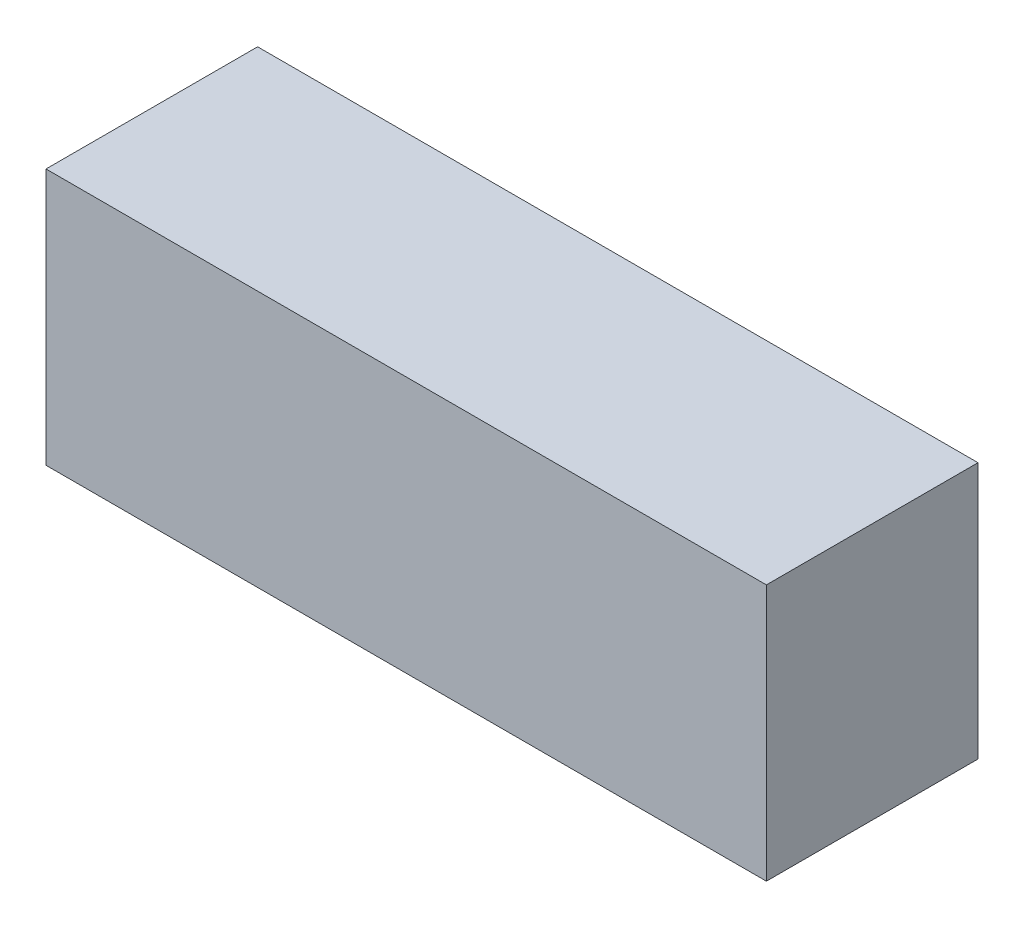
ISO-10303-21;
HEADER;
FILE_DESCRIPTION(('STEP AP214'),'2;1');
FILE_NAME('part.step','',(''),(''),'','','');
FILE_SCHEMA(('AUTOMOTIVE_DESIGN { 1 0 10303 214 1 1 1 1 }'));
ENDSEC;
DATA;
#1=APPLICATION_CONTEXT('core data for automotive mechanical design processes');
#2=APPLICATION_PROTOCOL_DEFINITION('international standard','automotive_design',2000,#1);
#3=PRODUCT_CONTEXT('',#1,'mechanical');
#4=PRODUCT('Part','Part','',(#3));
#5=PRODUCT_RELATED_PRODUCT_CATEGORY('part','',(#4));
#6=PRODUCT_DEFINITION_FORMATION('','',#4);
#7=PRODUCT_DEFINITION_CONTEXT('part definition',#1,'design');
#8=PRODUCT_DEFINITION('design','',#6,#7);
#9=PRODUCT_DEFINITION_SHAPE('','',#8);
#10=(LENGTH_UNIT() NAMED_UNIT(*) SI_UNIT(.MILLI.,.METRE.));
#11=(NAMED_UNIT(*) PLANE_ANGLE_UNIT() SI_UNIT($,.RADIAN.));
#12=(NAMED_UNIT(*) SI_UNIT($,.STERADIAN.) SOLID_ANGLE_UNIT());
#13=UNCERTAINTY_MEASURE_WITH_UNIT(LENGTH_MEASURE(1.E-05),#10,'distance_accuracy_value','');
#14=(GEOMETRIC_REPRESENTATION_CONTEXT(3) GLOBAL_UNCERTAINTY_ASSIGNED_CONTEXT((#13)) GLOBAL_UNIT_ASSIGNED_CONTEXT((#10,
#11,#12)) REPRESENTATION_CONTEXT('',''));
#15=CARTESIAN_POINT('',(0.,0.,0.));
#16=DIRECTION('',(0.,0.,1.));
#17=DIRECTION('',(1.,0.,0.));
#18=AXIS2_PLACEMENT_3D('',#15,#16,#17);
#19=CARTESIAN_POINT('',(80.,-28.5,47.));
#20=DIRECTION('',(-1.,0.,0.));
#21=DIRECTION('',(0.,0.,1.));
#22=AXIS2_PLACEMENT_3D('',#19,#20,#21);
#23=PLANE('',#22);
#24=DIRECTION('',(0.,1.,0.));
#25=VECTOR('',#24,1.);
#26=CARTESIAN_POINT('',(80.,-28.5,0.));
#27=LINE('',#26,#25);
#28=CARTESIAN_POINT('',(80.,-28.5,0.));
#29=VERTEX_POINT('',#28);
#30=CARTESIAN_POINT('',(80.,28.5,0.));
#31=VERTEX_POINT('',#30);
#32=EDGE_CURVE('E99',#29,#31,#27,.T.);
#33=ORIENTED_EDGE('',*,*,#32,.T.);
#34=DIRECTION('',(0.,0.,-1.));
#35=VECTOR('',#34,1.);
#36=CARTESIAN_POINT('',(80.,28.5,47.));
#37=LINE('',#36,#35);
#38=CARTESIAN_POINT('',(80.,28.5,47.));
#39=VERTEX_POINT('',#38);
#40=EDGE_CURVE('E11',#39,#31,#37,.T.);
#41=ORIENTED_EDGE('',*,*,#40,.F.);
#42=DIRECTION('',(0.,1.,0.));
#43=VECTOR('',#42,1.);
#44=CARTESIAN_POINT('',(80.,-28.5,47.));
#45=LINE('',#44,#43);
#46=CARTESIAN_POINT('',(80.,-28.5,47.));
#47=VERTEX_POINT('',#46);
#48=EDGE_CURVE('E87',#47,#39,#45,.T.);
#49=ORIENTED_EDGE('',*,*,#48,.F.);
#50=DIRECTION('',(0.,0.,-1.));
#51=VECTOR('',#50,1.);
#52=CARTESIAN_POINT('',(80.,-28.5,47.));
#53=LINE('',#52,#51);
#54=EDGE_CURVE('E95',#47,#29,#53,.T.);
#55=ORIENTED_EDGE('',*,*,#54,.T.);
#56=EDGE_LOOP('',(#33,#41,#49,#55));
#57=FACE_BOUND('',#56,.T.);
#58=ADVANCED_FACE('F36',(#57),#23,.F.);
#59=CARTESIAN_POINT('',(-80.,28.5,47.));
#60=DIRECTION('',(0.,-1.,0.));
#61=DIRECTION('',(0.,0.,-1.));
#62=AXIS2_PLACEMENT_3D('',#59,#60,#61);
#63=PLANE('',#62);
#64=DIRECTION('',(-1.,0.,0.));
#65=VECTOR('',#64,1.);
#66=CARTESIAN_POINT('',(-80.,28.5,0.));
#67=LINE('',#66,#65);
#68=CARTESIAN_POINT('',(-80.,28.5,0.));
#69=VERTEX_POINT('',#68);
#70=EDGE_CURVE('E91',#31,#69,#67,.T.);
#71=ORIENTED_EDGE('',*,*,#70,.T.);
#72=DIRECTION('',(0.,0.,-1.));
#73=VECTOR('',#72,1.);
#74=CARTESIAN_POINT('',(-80.,28.5,47.));
#75=LINE('',#74,#73);
#76=CARTESIAN_POINT('',(-80.,28.5,47.));
#77=VERTEX_POINT('',#76);
#78=EDGE_CURVE('E44',#77,#69,#75,.T.);
#79=ORIENTED_EDGE('',*,*,#78,.F.);
#80=DIRECTION('',(-1.,0.,0.));
#81=VECTOR('',#80,1.);
#82=CARTESIAN_POINT('',(-80.,28.5,47.));
#83=LINE('',#82,#81);
#84=EDGE_CURVE('E82',#39,#77,#83,.T.);
#85=ORIENTED_EDGE('',*,*,#84,.F.);
#86=ORIENTED_EDGE('',*,*,#40,.T.);
#87=EDGE_LOOP('',(#71,#79,#85,#86));
#88=FACE_BOUND('',#87,.T.);
#89=ADVANCED_FACE('F90',(#88),#63,.F.);
#90=CARTESIAN_POINT('',(-80.,-28.5,47.));
#91=DIRECTION('',(1.,0.,0.));
#92=DIRECTION('',(0.,0.,-1.));
#93=AXIS2_PLACEMENT_3D('',#90,#91,#92);
#94=PLANE('',#93);
#95=DIRECTION('',(0.,-1.,0.));
#96=VECTOR('',#95,1.);
#97=CARTESIAN_POINT('',(-80.,-28.5,0.));
#98=LINE('',#97,#96);
#99=CARTESIAN_POINT('',(-80.,-28.5,0.));
#100=VERTEX_POINT('',#99);
#101=EDGE_CURVE('E69',#69,#100,#98,.T.);
#102=ORIENTED_EDGE('',*,*,#101,.T.);
#103=DIRECTION('',(0.,0.,-1.));
#104=VECTOR('',#103,1.);
#105=CARTESIAN_POINT('',(-80.,-28.5,47.));
#106=LINE('',#105,#104);
#107=CARTESIAN_POINT('',(-80.,-28.5,47.));
#108=VERTEX_POINT('',#107);
#109=EDGE_CURVE('E92',#108,#100,#106,.T.);
#110=ORIENTED_EDGE('',*,*,#109,.F.);
#111=DIRECTION('',(0.,-1.,0.));
#112=VECTOR('',#111,1.);
#113=CARTESIAN_POINT('',(-80.,-28.5,47.));
#114=LINE('',#113,#112);
#115=EDGE_CURVE('E85',#77,#108,#114,.T.);
#116=ORIENTED_EDGE('',*,*,#115,.F.);
#117=ORIENTED_EDGE('',*,*,#78,.T.);
#118=EDGE_LOOP('',(#102,#110,#116,#117));
#119=FACE_BOUND('',#118,.T.);
#120=ADVANCED_FACE('F93',(#119),#94,.F.);
#121=CARTESIAN_POINT('',(-80.,-28.5,47.));
#122=DIRECTION('',(0.,1.,0.));
#123=DIRECTION('',(0.,0.,1.));
#124=AXIS2_PLACEMENT_3D('',#121,#122,#123);
#125=PLANE('',#124);
#126=DIRECTION('',(1.,0.,0.));
#127=VECTOR('',#126,1.);
#128=CARTESIAN_POINT('',(-80.,-28.5,0.));
#129=LINE('',#128,#127);
#130=EDGE_CURVE('E75',#100,#29,#129,.T.);
#131=ORIENTED_EDGE('',*,*,#130,.T.);
#132=ORIENTED_EDGE('',*,*,#54,.F.);
#133=DIRECTION('',(1.,0.,0.));
#134=VECTOR('',#133,1.);
#135=CARTESIAN_POINT('',(-80.,-28.5,47.));
#136=LINE('',#135,#134);
#137=EDGE_CURVE('E52',#108,#47,#136,.T.);
#138=ORIENTED_EDGE('',*,*,#137,.F.);
#139=ORIENTED_EDGE('',*,*,#109,.T.);
#140=EDGE_LOOP('',(#131,#132,#138,#139));
#141=FACE_BOUND('',#140,.T.);
#142=ADVANCED_FACE('F106',(#141),#125,.F.);
#143=CARTESIAN_POINT('',(0.,0.,47.));
#144=DIRECTION('',(0.,0.,-1.));
#145=DIRECTION('',(-1.,0.,0.));
#146=AXIS2_PLACEMENT_3D('',#143,#144,#145);
#147=PLANE('',#146);
#148=ORIENTED_EDGE('',*,*,#48,.T.);
#149=ORIENTED_EDGE('',*,*,#84,.T.);
#150=ORIENTED_EDGE('',*,*,#115,.T.);
#151=ORIENTED_EDGE('',*,*,#137,.T.);
#152=EDGE_LOOP('',(#148,#149,#150,#151));
#153=FACE_BOUND('',#152,.T.);
#154=ADVANCED_FACE('F83',(#153),#147,.F.);
#155=CARTESIAN_POINT('',(0.,0.,0.));
#156=DIRECTION('',(0.,0.,-1.));
#157=DIRECTION('',(-1.,0.,0.));
#158=AXIS2_PLACEMENT_3D('',#155,#156,#157);
#159=PLANE('',#158);
#160=ORIENTED_EDGE('',*,*,#32,.F.);
#161=ORIENTED_EDGE('',*,*,#130,.F.);
#162=ORIENTED_EDGE('',*,*,#101,.F.);
#163=ORIENTED_EDGE('',*,*,#70,.F.);
#164=EDGE_LOOP('',(#160,#161,#162,#163));
#165=FACE_BOUND('',#164,.T.);
#166=ADVANCED_FACE('F109',(#165),#159,.T.);
#167=CLOSED_SHELL('',(#58,#89,#120,#142,#154,#166));
#168=MANIFOLD_SOLID_BREP('B2',#167);
#169=ADVANCED_BREP_SHAPE_REPRESENTATION('',(#18,#168),#14);
#170=SHAPE_DEFINITION_REPRESENTATION(#9,#169);
ENDSEC;
END-ISO-10303-21;
